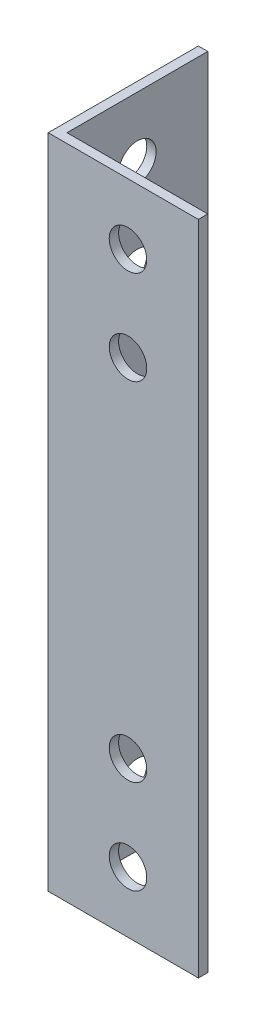
ISO-10303-21;
HEADER;
FILE_DESCRIPTION(('STEP AP214'),'2;1');
FILE_NAME('part.step','',(''),(''),'','','');
FILE_SCHEMA(('AUTOMOTIVE_DESIGN { 1 0 10303 214 1 1 1 1 }'));
ENDSEC;
DATA;
#1=APPLICATION_CONTEXT('core data for automotive mechanical design processes');
#2=APPLICATION_PROTOCOL_DEFINITION('international standard','automotive_design',2000,#1);
#3=PRODUCT_CONTEXT('',#1,'mechanical');
#4=PRODUCT('Part','Part','',(#3));
#5=PRODUCT_RELATED_PRODUCT_CATEGORY('part','',(#4));
#6=PRODUCT_DEFINITION_FORMATION('','',#4);
#7=PRODUCT_DEFINITION_CONTEXT('part definition',#1,'design');
#8=PRODUCT_DEFINITION('design','',#6,#7);
#9=PRODUCT_DEFINITION_SHAPE('','',#8);
#10=(LENGTH_UNIT() NAMED_UNIT(*) SI_UNIT(.MILLI.,.METRE.));
#11=(NAMED_UNIT(*) PLANE_ANGLE_UNIT() SI_UNIT($,.RADIAN.));
#12=(NAMED_UNIT(*) SI_UNIT($,.STERADIAN.) SOLID_ANGLE_UNIT());
#13=UNCERTAINTY_MEASURE_WITH_UNIT(LENGTH_MEASURE(1.E-05),#10,'distance_accuracy_value','');
#14=(GEOMETRIC_REPRESENTATION_CONTEXT(3) GLOBAL_UNCERTAINTY_ASSIGNED_CONTEXT((#13)) GLOBAL_UNIT_ASSIGNED_CONTEXT((#10,
#11,#12)) REPRESENTATION_CONTEXT('',''));
#15=CARTESIAN_POINT('',(0.,0.,0.));
#16=DIRECTION('',(0.,0.,1.));
#17=DIRECTION('',(1.,0.,0.));
#18=AXIS2_PLACEMENT_3D('',#15,#16,#17);
#19=CARTESIAN_POINT('',(16.,70.,0.));
#20=DIRECTION('',(0.,0.,-1.));
#21=DIRECTION('',(-1.,0.,0.));
#22=AXIS2_PLACEMENT_3D('',#19,#20,#21);
#23=PLANE('',#22);
#24=CARTESIAN_POINT('',(8.50000000000001,16.5,0.));
#25=DIRECTION('',(0.,0.,-1.));
#26=DIRECTION('',(-1.,0.,0.));
#27=AXIS2_PLACEMENT_3D('',#24,#25,#26);
#28=CIRCLE('',#27,2.);
#29=CARTESIAN_POINT('',(6.50000000000001,16.5,0.));
#30=VERTEX_POINT('',#29);
#31=EDGE_CURVE('E161',#30,#30,#28,.F.);
#32=ORIENTED_EDGE('',*,*,#31,.F.);
#33=EDGE_LOOP('',(#32));
#34=FACE_BOUND('',#33,.T.);
#35=CARTESIAN_POINT('',(8.50000000000001,6.50000000000001,0.));
#36=DIRECTION('',(0.,0.,-1.));
#37=DIRECTION('',(-1.,0.,0.));
#38=AXIS2_PLACEMENT_3D('',#35,#36,#37);
#39=CIRCLE('',#38,2.);
#40=CARTESIAN_POINT('',(6.50000000000001,6.50000000000001,0.));
#41=VERTEX_POINT('',#40);
#42=EDGE_CURVE('E165',#41,#41,#39,.F.);
#43=ORIENTED_EDGE('',*,*,#42,.F.);
#44=EDGE_LOOP('',(#43));
#45=FACE_BOUND('',#44,.T.);
#46=CARTESIAN_POINT('',(8.50000000000001,63.5,0.));
#47=DIRECTION('',(0.,0.,-1.));
#48=DIRECTION('',(-1.,0.,0.));
#49=AXIS2_PLACEMENT_3D('',#46,#47,#48);
#50=CIRCLE('',#49,2.);
#51=CARTESIAN_POINT('',(6.50000000000001,63.5,0.));
#52=VERTEX_POINT('',#51);
#53=EDGE_CURVE('E169',#52,#52,#50,.F.);
#54=ORIENTED_EDGE('',*,*,#53,.F.);
#55=EDGE_LOOP('',(#54));
#56=FACE_BOUND('',#55,.T.);
#57=CARTESIAN_POINT('',(8.50000000000001,53.5,0.));
#58=DIRECTION('',(0.,0.,-1.));
#59=DIRECTION('',(-1.,0.,0.));
#60=AXIS2_PLACEMENT_3D('',#57,#58,#59);
#61=CIRCLE('',#60,2.);
#62=CARTESIAN_POINT('',(6.50000000000001,53.5,0.));
#63=VERTEX_POINT('',#62);
#64=EDGE_CURVE('E172',#63,#63,#61,.F.);
#65=ORIENTED_EDGE('',*,*,#64,.F.);
#66=EDGE_LOOP('',(#65));
#67=FACE_BOUND('',#66,.T.);
#68=DIRECTION('',(1.,0.,0.));
#69=VECTOR('',#68,1.);
#70=CARTESIAN_POINT('',(16.,0.,0.));
#71=LINE('',#70,#69);
#72=CARTESIAN_POINT('',(0.,0.,0.));
#73=VERTEX_POINT('',#72);
#74=CARTESIAN_POINT('',(16.,0.,0.));
#75=VERTEX_POINT('',#74);
#76=EDGE_CURVE('E115',#73,#75,#71,.T.);
#77=ORIENTED_EDGE('',*,*,#76,.T.);
#78=DIRECTION('',(0.,-1.,0.));
#79=VECTOR('',#78,1.);
#80=CARTESIAN_POINT('',(16.,70.,0.));
#81=LINE('',#80,#79);
#82=CARTESIAN_POINT('',(16.,70.,0.));
#83=VERTEX_POINT('',#82);
#84=EDGE_CURVE('E11',#83,#75,#81,.T.);
#85=ORIENTED_EDGE('',*,*,#84,.F.);
#86=DIRECTION('',(1.,0.,0.));
#87=VECTOR('',#86,1.);
#88=CARTESIAN_POINT('',(16.,70.,0.));
#89=LINE('',#88,#87);
#90=CARTESIAN_POINT('',(0.,70.,0.));
#91=VERTEX_POINT('',#90);
#92=EDGE_CURVE('E126',#91,#83,#89,.T.);
#93=ORIENTED_EDGE('',*,*,#92,.F.);
#94=DIRECTION('',(0.,-1.,0.));
#95=VECTOR('',#94,1.);
#96=CARTESIAN_POINT('',(0.,70.,0.));
#97=LINE('',#96,#95);
#98=EDGE_CURVE('E111',#91,#73,#97,.T.);
#99=ORIENTED_EDGE('',*,*,#98,.T.);
#100=EDGE_LOOP('',(#77,#85,#93,#99));
#101=FACE_BOUND('',#100,.T.);
#102=ADVANCED_FACE('F31',(#34,#45,#56,#67,#101),#23,.F.);
#103=CARTESIAN_POINT('',(16.,70.,-1.00000000000007));
#104=DIRECTION('',(-1.,0.,0.));
#105=DIRECTION('',(0.,0.,1.));
#106=AXIS2_PLACEMENT_3D('',#103,#104,#105);
#107=PLANE('',#106);
#108=DIRECTION('',(0.,0.,-1.));
#109=VECTOR('',#108,1.);
#110=CARTESIAN_POINT('',(16.,0.,-1.00000000000007));
#111=LINE('',#110,#109);
#112=CARTESIAN_POINT('',(16.,0.,-1.00000000000007));
#113=VERTEX_POINT('',#112);
#114=EDGE_CURVE('E118',#75,#113,#111,.T.);
#115=ORIENTED_EDGE('',*,*,#114,.T.);
#116=DIRECTION('',(0.,-1.,0.));
#117=VECTOR('',#116,1.);
#118=CARTESIAN_POINT('',(16.,70.,-1.00000000000007));
#119=LINE('',#118,#117);
#120=CARTESIAN_POINT('',(16.,70.,-1.00000000000007));
#121=VERTEX_POINT('',#120);
#122=EDGE_CURVE('E39',#121,#113,#119,.T.);
#123=ORIENTED_EDGE('',*,*,#122,.F.);
#124=DIRECTION('',(0.,0.,-1.));
#125=VECTOR('',#124,1.);
#126=CARTESIAN_POINT('',(16.,70.,-1.00000000000007));
#127=LINE('',#126,#125);
#128=EDGE_CURVE('E84',#83,#121,#127,.T.);
#129=ORIENTED_EDGE('',*,*,#128,.F.);
#130=ORIENTED_EDGE('',*,*,#84,.T.);
#131=EDGE_LOOP('',(#115,#123,#129,#130));
#132=FACE_BOUND('',#131,.T.);
#133=ADVANCED_FACE('F153',(#132),#107,.F.);
#134=CARTESIAN_POINT('',(1.,70.,-1.));
#135=DIRECTION('',(0.,0.,1.));
#136=DIRECTION('',(1.,0.,0.));
#137=AXIS2_PLACEMENT_3D('',#134,#135,#136);
#138=PLANE('',#137);
#139=CARTESIAN_POINT('',(8.50000000000001,16.5,-1.00000000000003));
#140=DIRECTION('',(0.,0.,-1.));
#141=DIRECTION('',(1.,0.,0.));
#142=AXIS2_PLACEMENT_3D('',#139,#140,#141);
#143=CIRCLE('',#142,2.);
#144=CARTESIAN_POINT('',(10.5,16.5,-1.00000000000004));
#145=VERTEX_POINT('',#144);
#146=EDGE_CURVE('E247',#145,#145,#143,.T.);
#147=ORIENTED_EDGE('',*,*,#146,.F.);
#148=EDGE_LOOP('',(#147));
#149=FACE_BOUND('',#148,.T.);
#150=CARTESIAN_POINT('',(8.50000000000001,6.50000000000001,-1.00000000000003));
#151=DIRECTION('',(0.,0.,-1.));
#152=DIRECTION('',(1.,0.,0.));
#153=AXIS2_PLACEMENT_3D('',#150,#151,#152);
#154=CIRCLE('',#153,2.);
#155=CARTESIAN_POINT('',(10.5,6.50000000000001,-1.00000000000004));
#156=VERTEX_POINT('',#155);
#157=EDGE_CURVE('E248',#156,#156,#154,.T.);
#158=ORIENTED_EDGE('',*,*,#157,.F.);
#159=EDGE_LOOP('',(#158));
#160=FACE_BOUND('',#159,.T.);
#161=CARTESIAN_POINT('',(8.50000000000001,63.5,-1.00000000000003));
#162=DIRECTION('',(0.,0.,-1.));
#163=DIRECTION('',(-1.,0.,0.));
#164=AXIS2_PLACEMENT_3D('',#161,#162,#163);
#165=CIRCLE('',#164,2.);
#166=CARTESIAN_POINT('',(6.50000000000001,63.5,-1.00000000000003));
#167=VERTEX_POINT('',#166);
#168=EDGE_CURVE('E255',#167,#167,#165,.T.);
#169=ORIENTED_EDGE('',*,*,#168,.F.);
#170=EDGE_LOOP('',(#169));
#171=FACE_BOUND('',#170,.T.);
#172=CARTESIAN_POINT('',(8.50000000000001,53.5,-1.00000000000003));
#173=DIRECTION('',(0.,0.,-1.));
#174=DIRECTION('',(-1.,0.,0.));
#175=AXIS2_PLACEMENT_3D('',#172,#173,#174);
#176=CIRCLE('',#175,2.);
#177=CARTESIAN_POINT('',(6.50000000000001,53.5,-1.00000000000003));
#178=VERTEX_POINT('',#177);
#179=EDGE_CURVE('E175',#178,#178,#176,.T.);
#180=ORIENTED_EDGE('',*,*,#179,.F.);
#181=EDGE_LOOP('',(#180));
#182=FACE_BOUND('',#181,.T.);
#183=DIRECTION('',(-1.,0.,0.));
#184=VECTOR('',#183,1.);
#185=CARTESIAN_POINT('',(1.,0.,-1.));
#186=LINE('',#185,#184);
#187=CARTESIAN_POINT('',(1.,0.,-1.));
#188=VERTEX_POINT('',#187);
#189=EDGE_CURVE('E121',#113,#188,#186,.T.);
#190=ORIENTED_EDGE('',*,*,#189,.T.);
#191=DIRECTION('',(0.,-1.,0.));
#192=VECTOR('',#191,1.);
#193=CARTESIAN_POINT('',(1.,70.,-1.));
#194=LINE('',#193,#192);
#195=CARTESIAN_POINT('',(1.,70.,-1.));
#196=VERTEX_POINT('',#195);
#197=EDGE_CURVE('E106',#196,#188,#194,.T.);
#198=ORIENTED_EDGE('',*,*,#197,.F.);
#199=DIRECTION('',(-1.,0.,0.));
#200=VECTOR('',#199,1.);
#201=CARTESIAN_POINT('',(1.,70.,-1.));
#202=LINE('',#201,#200);
#203=EDGE_CURVE('E97',#121,#196,#202,.T.);
#204=ORIENTED_EDGE('',*,*,#203,.F.);
#205=ORIENTED_EDGE('',*,*,#122,.T.);
#206=EDGE_LOOP('',(#190,#198,#204,#205));
#207=FACE_BOUND('',#206,.T.);
#208=ADVANCED_FACE('F132',(#149,#160,#171,#182,#207),#138,.F.);
#209=CARTESIAN_POINT('',(1.,70.,-16.));
#210=DIRECTION('',(-1.,0.,0.));
#211=DIRECTION('',(0.,0.,1.));
#212=AXIS2_PLACEMENT_3D('',#209,#210,#211);
#213=PLANE('',#212);
#214=CARTESIAN_POINT('',(1.,63.5,-8.5));
#215=DIRECTION('',(1.,0.,0.));
#216=DIRECTION('',(0.,0.,1.));
#217=AXIS2_PLACEMENT_3D('',#214,#215,#216);
#218=CIRCLE('',#217,2.);
#219=CARTESIAN_POINT('',(1.,63.5,-6.5));
#220=VERTEX_POINT('',#219);
#221=EDGE_CURVE('E174',#220,#220,#218,.T.);
#222=ORIENTED_EDGE('',*,*,#221,.F.);
#223=EDGE_LOOP('',(#222));
#224=FACE_BOUND('',#223,.T.);
#225=CARTESIAN_POINT('',(1.,53.5,-8.5));
#226=DIRECTION('',(1.,0.,0.));
#227=DIRECTION('',(0.,0.,1.));
#228=AXIS2_PLACEMENT_3D('',#225,#226,#227);
#229=CIRCLE('',#228,2.);
#230=CARTESIAN_POINT('',(1.,53.5,-6.5));
#231=VERTEX_POINT('',#230);
#232=EDGE_CURVE('E186',#231,#231,#229,.T.);
#233=ORIENTED_EDGE('',*,*,#232,.F.);
#234=EDGE_LOOP('',(#233));
#235=FACE_BOUND('',#234,.T.);
#236=CARTESIAN_POINT('',(1.,6.5,-8.5));
#237=DIRECTION('',(1.,0.,0.));
#238=DIRECTION('',(0.,0.,-1.));
#239=AXIS2_PLACEMENT_3D('',#236,#237,#238);
#240=CIRCLE('',#239,2.);
#241=CARTESIAN_POINT('',(1.,6.5,-10.5));
#242=VERTEX_POINT('',#241);
#243=EDGE_CURVE('E192',#242,#242,#240,.T.);
#244=ORIENTED_EDGE('',*,*,#243,.F.);
#245=EDGE_LOOP('',(#244));
#246=FACE_BOUND('',#245,.T.);
#247=CARTESIAN_POINT('',(1.,16.5,-8.5));
#248=DIRECTION('',(1.,0.,0.));
#249=DIRECTION('',(0.,0.,-1.));
#250=AXIS2_PLACEMENT_3D('',#247,#248,#249);
#251=CIRCLE('',#250,2.);
#252=CARTESIAN_POINT('',(1.,16.5,-10.5));
#253=VERTEX_POINT('',#252);
#254=EDGE_CURVE('E198',#253,#253,#251,.T.);
#255=ORIENTED_EDGE('',*,*,#254,.F.);
#256=EDGE_LOOP('',(#255));
#257=FACE_BOUND('',#256,.T.);
#258=DIRECTION('',(0.,0.,-1.));
#259=VECTOR('',#258,1.);
#260=CARTESIAN_POINT('',(1.,0.,-16.));
#261=LINE('',#260,#259);
#262=CARTESIAN_POINT('',(1.,0.,-16.));
#263=VERTEX_POINT('',#262);
#264=EDGE_CURVE('E105',#188,#263,#261,.T.);
#265=ORIENTED_EDGE('',*,*,#264,.T.);
#266=DIRECTION('',(0.,-1.,0.));
#267=VECTOR('',#266,1.);
#268=CARTESIAN_POINT('',(1.,70.,-16.));
#269=LINE('',#268,#267);
#270=CARTESIAN_POINT('',(1.,70.,-16.));
#271=VERTEX_POINT('',#270);
#272=EDGE_CURVE('E102',#271,#263,#269,.T.);
#273=ORIENTED_EDGE('',*,*,#272,.F.);
#274=DIRECTION('',(0.,0.,-1.));
#275=VECTOR('',#274,1.);
#276=CARTESIAN_POINT('',(1.,70.,-16.));
#277=LINE('',#276,#275);
#278=EDGE_CURVE('E91',#196,#271,#277,.T.);
#279=ORIENTED_EDGE('',*,*,#278,.F.);
#280=ORIENTED_EDGE('',*,*,#197,.T.);
#281=EDGE_LOOP('',(#265,#273,#279,#280));
#282=FACE_BOUND('',#281,.T.);
#283=ADVANCED_FACE('F103',(#224,#235,#246,#257,#282),#213,.F.);
#284=CARTESIAN_POINT('',(0.,70.,-16.));
#285=DIRECTION('',(0.,0.,1.));
#286=DIRECTION('',(1.,0.,0.));
#287=AXIS2_PLACEMENT_3D('',#284,#285,#286);
#288=PLANE('',#287);
#289=DIRECTION('',(-1.,0.,0.));
#290=VECTOR('',#289,1.);
#291=CARTESIAN_POINT('',(0.,0.,-16.));
#292=LINE('',#291,#290);
#293=CARTESIAN_POINT('',(0.,0.,-16.));
#294=VERTEX_POINT('',#293);
#295=EDGE_CURVE('E70',#263,#294,#292,.T.);
#296=ORIENTED_EDGE('',*,*,#295,.T.);
#297=DIRECTION('',(0.,-1.,0.));
#298=VECTOR('',#297,1.);
#299=CARTESIAN_POINT('',(0.,70.,-16.));
#300=LINE('',#299,#298);
#301=CARTESIAN_POINT('',(0.,70.,-16.));
#302=VERTEX_POINT('',#301);
#303=EDGE_CURVE('E107',#302,#294,#300,.T.);
#304=ORIENTED_EDGE('',*,*,#303,.F.);
#305=DIRECTION('',(-1.,0.,0.));
#306=VECTOR('',#305,1.);
#307=CARTESIAN_POINT('',(0.,70.,-16.));
#308=LINE('',#307,#306);
#309=EDGE_CURVE('E95',#271,#302,#308,.T.);
#310=ORIENTED_EDGE('',*,*,#309,.F.);
#311=ORIENTED_EDGE('',*,*,#272,.T.);
#312=EDGE_LOOP('',(#296,#304,#310,#311));
#313=FACE_BOUND('',#312,.T.);
#314=ADVANCED_FACE('F109',(#313),#288,.F.);
#315=CARTESIAN_POINT('',(0.,70.,0.));
#316=DIRECTION('',(1.,0.,0.));
#317=DIRECTION('',(0.,0.,-1.));
#318=AXIS2_PLACEMENT_3D('',#315,#316,#317);
#319=PLANE('',#318);
#320=CARTESIAN_POINT('',(0.,63.5,-8.5));
#321=DIRECTION('',(1.,0.,0.));
#322=DIRECTION('',(0.,0.,-1.));
#323=AXIS2_PLACEMENT_3D('',#320,#321,#322);
#324=CIRCLE('',#323,2.);
#325=CARTESIAN_POINT('',(0.,63.5,-10.5));
#326=VERTEX_POINT('',#325);
#327=EDGE_CURVE('E178',#326,#326,#324,.F.);
#328=ORIENTED_EDGE('',*,*,#327,.F.);
#329=EDGE_LOOP('',(#328));
#330=FACE_BOUND('',#329,.T.);
#331=CARTESIAN_POINT('',(0.,53.5,-8.5));
#332=DIRECTION('',(1.,0.,0.));
#333=DIRECTION('',(0.,0.,-1.));
#334=AXIS2_PLACEMENT_3D('',#331,#332,#333);
#335=CIRCLE('',#334,2.);
#336=CARTESIAN_POINT('',(0.,53.5,-10.5));
#337=VERTEX_POINT('',#336);
#338=EDGE_CURVE('E189',#337,#337,#335,.F.);
#339=ORIENTED_EDGE('',*,*,#338,.F.);
#340=EDGE_LOOP('',(#339));
#341=FACE_BOUND('',#340,.T.);
#342=CARTESIAN_POINT('',(0.,6.5,-8.5));
#343=DIRECTION('',(1.,0.,0.));
#344=DIRECTION('',(0.,0.,-1.));
#345=AXIS2_PLACEMENT_3D('',#342,#343,#344);
#346=CIRCLE('',#345,2.);
#347=CARTESIAN_POINT('',(0.,6.5,-10.5));
#348=VERTEX_POINT('',#347);
#349=EDGE_CURVE('E195',#348,#348,#346,.F.);
#350=ORIENTED_EDGE('',*,*,#349,.F.);
#351=EDGE_LOOP('',(#350));
#352=FACE_BOUND('',#351,.T.);
#353=CARTESIAN_POINT('',(0.,16.5,-8.5));
#354=DIRECTION('',(1.,0.,0.));
#355=DIRECTION('',(0.,0.,-1.));
#356=AXIS2_PLACEMENT_3D('',#353,#354,#355);
#357=CIRCLE('',#356,2.);
#358=CARTESIAN_POINT('',(0.,16.5,-10.5));
#359=VERTEX_POINT('',#358);
#360=EDGE_CURVE('E119',#359,#359,#357,.F.);
#361=ORIENTED_EDGE('',*,*,#360,.F.);
#362=EDGE_LOOP('',(#361));
#363=FACE_BOUND('',#362,.T.);
#364=DIRECTION('',(0.,0.,1.));
#365=VECTOR('',#364,1.);
#366=CARTESIAN_POINT('',(0.,0.,0.));
#367=LINE('',#366,#365);
#368=EDGE_CURVE('E76',#294,#73,#367,.T.);
#369=ORIENTED_EDGE('',*,*,#368,.T.);
#370=ORIENTED_EDGE('',*,*,#98,.F.);
#371=DIRECTION('',(0.,0.,1.));
#372=VECTOR('',#371,1.);
#373=CARTESIAN_POINT('',(0.,70.,0.));
#374=LINE('',#373,#372);
#375=EDGE_CURVE('E47',#302,#91,#374,.T.);
#376=ORIENTED_EDGE('',*,*,#375,.F.);
#377=ORIENTED_EDGE('',*,*,#303,.T.);
#378=EDGE_LOOP('',(#369,#370,#376,#377));
#379=FACE_BOUND('',#378,.T.);
#380=ADVANCED_FACE('F139',(#330,#341,#352,#363,#379),#319,.F.);
#381=CARTESIAN_POINT('',(0.,70.,0.));
#382=DIRECTION('',(0.,-1.,0.));
#383=DIRECTION('',(0.,0.,-1.));
#384=AXIS2_PLACEMENT_3D('',#381,#382,#383);
#385=PLANE('',#384);
#386=ORIENTED_EDGE('',*,*,#92,.T.);
#387=ORIENTED_EDGE('',*,*,#128,.T.);
#388=ORIENTED_EDGE('',*,*,#203,.T.);
#389=ORIENTED_EDGE('',*,*,#278,.T.);
#390=ORIENTED_EDGE('',*,*,#309,.T.);
#391=ORIENTED_EDGE('',*,*,#375,.T.);
#392=EDGE_LOOP('',(#386,#387,#388,#389,#390,#391));
#393=FACE_BOUND('',#392,.T.);
#394=ADVANCED_FACE('F93',(#393),#385,.F.);
#395=CARTESIAN_POINT('',(0.,0.,0.));
#396=DIRECTION('',(0.,-1.,0.));
#397=DIRECTION('',(0.,0.,-1.));
#398=AXIS2_PLACEMENT_3D('',#395,#396,#397);
#399=PLANE('',#398);
#400=ORIENTED_EDGE('',*,*,#76,.F.);
#401=ORIENTED_EDGE('',*,*,#368,.F.);
#402=ORIENTED_EDGE('',*,*,#295,.F.);
#403=ORIENTED_EDGE('',*,*,#264,.F.);
#404=ORIENTED_EDGE('',*,*,#189,.F.);
#405=ORIENTED_EDGE('',*,*,#114,.F.);
#406=EDGE_LOOP('',(#400,#401,#402,#403,#404,#405));
#407=FACE_BOUND('',#406,.T.);
#408=ADVANCED_FACE('F135',(#407),#399,.T.);
#409=CARTESIAN_POINT('',(-0.001000000000001,16.5,-8.5));
#410=DIRECTION('',(1.,0.,0.));
#411=DIRECTION('',(0.,0.,-1.));
#412=AXIS2_PLACEMENT_3D('',#409,#410,#411);
#413=CYLINDRICAL_SURFACE('',#412,2.);
#414=ORIENTED_EDGE('',*,*,#254,.T.);
#415=EDGE_LOOP('',(#414));
#416=FACE_BOUND('',#415,.T.);
#417=ORIENTED_EDGE('',*,*,#360,.T.);
#418=EDGE_LOOP('',(#417));
#419=FACE_BOUND('',#418,.T.);
#420=ADVANCED_FACE('F206',(#416,#419),#413,.F.);
#421=CARTESIAN_POINT('',(-0.001000000000001,6.5,-8.5));
#422=DIRECTION('',(1.,0.,0.));
#423=DIRECTION('',(0.,0.,-1.));
#424=AXIS2_PLACEMENT_3D('',#421,#422,#423);
#425=CYLINDRICAL_SURFACE('',#424,2.);
#426=ORIENTED_EDGE('',*,*,#243,.T.);
#427=EDGE_LOOP('',(#426));
#428=FACE_BOUND('',#427,.T.);
#429=ORIENTED_EDGE('',*,*,#349,.T.);
#430=EDGE_LOOP('',(#429));
#431=FACE_BOUND('',#430,.T.);
#432=ADVANCED_FACE('F209',(#428,#431),#425,.F.);
#433=CARTESIAN_POINT('',(-0.001000000000001,53.5,-8.5));
#434=DIRECTION('',(1.,0.,0.));
#435=DIRECTION('',(0.,0.,-1.));
#436=AXIS2_PLACEMENT_3D('',#433,#434,#435);
#437=CYLINDRICAL_SURFACE('',#436,2.);
#438=ORIENTED_EDGE('',*,*,#232,.T.);
#439=EDGE_LOOP('',(#438));
#440=FACE_BOUND('',#439,.T.);
#441=ORIENTED_EDGE('',*,*,#338,.T.);
#442=EDGE_LOOP('',(#441));
#443=FACE_BOUND('',#442,.T.);
#444=ADVANCED_FACE('F216',(#440,#443),#437,.F.);
#445=CARTESIAN_POINT('',(-0.001000000000001,63.5,-8.5));
#446=DIRECTION('',(1.,0.,0.));
#447=DIRECTION('',(0.,0.,-1.));
#448=AXIS2_PLACEMENT_3D('',#445,#446,#447);
#449=CYLINDRICAL_SURFACE('',#448,2.);
#450=ORIENTED_EDGE('',*,*,#221,.T.);
#451=EDGE_LOOP('',(#450));
#452=FACE_BOUND('',#451,.T.);
#453=ORIENTED_EDGE('',*,*,#327,.T.);
#454=EDGE_LOOP('',(#453));
#455=FACE_BOUND('',#454,.T.);
#456=ADVANCED_FACE('F222',(#452,#455),#449,.F.);
#457=CARTESIAN_POINT('',(8.50000000000001,53.5,0.00100000000003049));
#458=DIRECTION('',(0.,0.,-1.));
#459=DIRECTION('',(-1.,0.,0.));
#460=AXIS2_PLACEMENT_3D('',#457,#458,#459);
#461=CYLINDRICAL_SURFACE('',#460,2.);
#462=ORIENTED_EDGE('',*,*,#179,.T.);
#463=EDGE_LOOP('',(#462));
#464=FACE_BOUND('',#463,.T.);
#465=ORIENTED_EDGE('',*,*,#64,.T.);
#466=EDGE_LOOP('',(#465));
#467=FACE_BOUND('',#466,.T.);
#468=ADVANCED_FACE('F226',(#464,#467),#461,.F.);
#469=CARTESIAN_POINT('',(8.50000000000001,63.5,0.00100000000003049));
#470=DIRECTION('',(0.,0.,-1.));
#471=DIRECTION('',(-1.,0.,0.));
#472=AXIS2_PLACEMENT_3D('',#469,#470,#471);
#473=CYLINDRICAL_SURFACE('',#472,2.);
#474=ORIENTED_EDGE('',*,*,#168,.T.);
#475=EDGE_LOOP('',(#474));
#476=FACE_BOUND('',#475,.T.);
#477=ORIENTED_EDGE('',*,*,#53,.T.);
#478=EDGE_LOOP('',(#477));
#479=FACE_BOUND('',#478,.T.);
#480=ADVANCED_FACE('F230',(#476,#479),#473,.F.);
#481=CARTESIAN_POINT('',(8.50000000000001,6.50000000000001,0.00100000000003049));
#482=DIRECTION('',(0.,0.,-1.));
#483=DIRECTION('',(-1.,0.,0.));
#484=AXIS2_PLACEMENT_3D('',#481,#482,#483);
#485=CYLINDRICAL_SURFACE('',#484,2.);
#486=ORIENTED_EDGE('',*,*,#157,.T.);
#487=EDGE_LOOP('',(#486));
#488=FACE_BOUND('',#487,.T.);
#489=ORIENTED_EDGE('',*,*,#42,.T.);
#490=EDGE_LOOP('',(#489));
#491=FACE_BOUND('',#490,.T.);
#492=ADVANCED_FACE('F234',(#488,#491),#485,.F.);
#493=CARTESIAN_POINT('',(8.50000000000001,16.5,0.00100000000003049));
#494=DIRECTION('',(0.,0.,-1.));
#495=DIRECTION('',(-1.,0.,0.));
#496=AXIS2_PLACEMENT_3D('',#493,#494,#495);
#497=CYLINDRICAL_SURFACE('',#496,2.);
#498=ORIENTED_EDGE('',*,*,#146,.T.);
#499=EDGE_LOOP('',(#498));
#500=FACE_BOUND('',#499,.T.);
#501=ORIENTED_EDGE('',*,*,#31,.T.);
#502=EDGE_LOOP('',(#501));
#503=FACE_BOUND('',#502,.T.);
#504=ADVANCED_FACE('F238',(#500,#503),#497,.F.);
#505=CLOSED_SHELL('',(#102,#133,#208,#283,#314,#380,#394,#408,#420,#432,#444,#456,#468,#480,
#492,#504));
#506=MANIFOLD_SOLID_BREP('B2',#505);
#507=ADVANCED_BREP_SHAPE_REPRESENTATION('',(#18,#506),#14);
#508=SHAPE_DEFINITION_REPRESENTATION(#9,#507);
ENDSEC;
END-ISO-10303-21;
